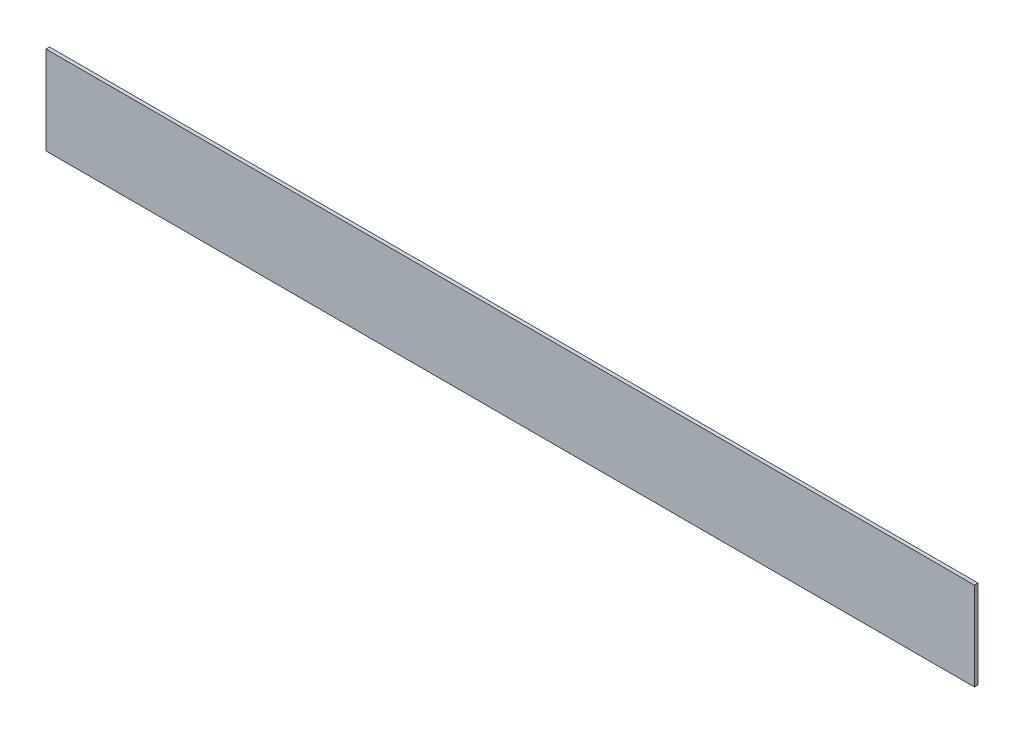
ISO-10303-21;
HEADER;
FILE_DESCRIPTION(('STEP AP214'),'2;1');
FILE_NAME('part.step','',(''),(''),'','','');
FILE_SCHEMA(('AUTOMOTIVE_DESIGN { 1 0 10303 214 1 1 1 1 }'));
ENDSEC;
DATA;
#1=APPLICATION_CONTEXT('core data for automotive mechanical design processes');
#2=APPLICATION_PROTOCOL_DEFINITION('international standard','automotive_design',2000,#1);
#3=PRODUCT_CONTEXT('',#1,'mechanical');
#4=PRODUCT('Part','Part','',(#3));
#5=PRODUCT_RELATED_PRODUCT_CATEGORY('part','',(#4));
#6=PRODUCT_DEFINITION_FORMATION('','',#4);
#7=PRODUCT_DEFINITION_CONTEXT('part definition',#1,'design');
#8=PRODUCT_DEFINITION('design','',#6,#7);
#9=PRODUCT_DEFINITION_SHAPE('','',#8);
#10=(LENGTH_UNIT() NAMED_UNIT(*) SI_UNIT(.MILLI.,.METRE.));
#11=(NAMED_UNIT(*) PLANE_ANGLE_UNIT() SI_UNIT($,.RADIAN.));
#12=(NAMED_UNIT(*) SI_UNIT($,.STERADIAN.) SOLID_ANGLE_UNIT());
#13=UNCERTAINTY_MEASURE_WITH_UNIT(LENGTH_MEASURE(1.E-05),#10,'distance_accuracy_value','');
#14=(GEOMETRIC_REPRESENTATION_CONTEXT(3) GLOBAL_UNCERTAINTY_ASSIGNED_CONTEXT((#13)) GLOBAL_UNIT_ASSIGNED_CONTEXT((#10,
#11,#12)) REPRESENTATION_CONTEXT('',''));
#15=CARTESIAN_POINT('',(0.,0.,0.));
#16=DIRECTION('',(0.,0.,1.));
#17=DIRECTION('',(1.,0.,0.));
#18=AXIS2_PLACEMENT_3D('',#15,#16,#17);
#19=CARTESIAN_POINT('',(-262.860436893204,1093.,778.732828821742));
#20=DIRECTION('',(-1.,0.,0.));
#21=DIRECTION('',(0.,0.,1.));
#22=AXIS2_PLACEMENT_3D('',#19,#20,#21);
#23=PLANE('',#22);
#24=DIRECTION('',(0.,-1.,0.));
#25=VECTOR('',#24,1.);
#26=CARTESIAN_POINT('',(-262.860436893204,1093.,780.732828821742));
#27=LINE('',#26,#25);
#28=CARTESIAN_POINT('',(-262.860436893204,1093.,780.732828821742));
#29=VERTEX_POINT('',#28);
#30=CARTESIAN_POINT('',(-262.860436893204,1043.,780.732828821742));
#31=VERTEX_POINT('',#30);
#32=EDGE_CURVE('E111',#29,#31,#27,.T.);
#33=ORIENTED_EDGE('',*,*,#32,.F.);
#34=DIRECTION('',(0.,0.,1.));
#35=VECTOR('',#34,1.);
#36=CARTESIAN_POINT('',(-262.860436893204,1093.,778.732828821742));
#37=LINE('',#36,#35);
#38=CARTESIAN_POINT('',(-262.860436893204,1093.,778.732828821742));
#39=VERTEX_POINT('',#38);
#40=EDGE_CURVE('E11',#39,#29,#37,.T.);
#41=ORIENTED_EDGE('',*,*,#40,.F.);
#42=DIRECTION('',(0.,-1.,0.));
#43=VECTOR('',#42,1.);
#44=CARTESIAN_POINT('',(-262.860436893204,1093.,778.732828821742));
#45=LINE('',#44,#43);
#46=CARTESIAN_POINT('',(-262.860436893204,1043.,778.732828821742));
#47=VERTEX_POINT('',#46);
#48=EDGE_CURVE('E102',#39,#47,#45,.T.);
#49=ORIENTED_EDGE('',*,*,#48,.T.);
#50=DIRECTION('',(0.,0.,1.));
#51=VECTOR('',#50,1.);
#52=CARTESIAN_POINT('',(-262.860436893204,1043.,778.732828821742));
#53=LINE('',#52,#51);
#54=EDGE_CURVE('E43',#47,#31,#53,.T.);
#55=ORIENTED_EDGE('',*,*,#54,.T.);
#56=EDGE_LOOP('',(#33,#41,#49,#55));
#57=FACE_BOUND('',#56,.T.);
#58=ADVANCED_FACE('F40',(#57),#23,.T.);
#59=CARTESIAN_POINT('',(-262.860436893204,1093.,778.732828821742));
#60=DIRECTION('',(0.,1.,0.));
#61=DIRECTION('',(0.,0.,1.));
#62=AXIS2_PLACEMENT_3D('',#59,#60,#61);
#63=PLANE('',#62);
#64=DIRECTION('',(-1.,0.,0.));
#65=VECTOR('',#64,1.);
#66=CARTESIAN_POINT('',(-262.860436893204,1093.,780.732828821742));
#67=LINE('',#66,#65);
#68=CARTESIAN_POINT('',(262.860436893204,1093.,780.732828821742));
#69=VERTEX_POINT('',#68);
#70=EDGE_CURVE('E106',#69,#29,#67,.T.);
#71=ORIENTED_EDGE('',*,*,#70,.F.);
#72=DIRECTION('',(0.,0.,1.));
#73=VECTOR('',#72,1.);
#74=CARTESIAN_POINT('',(262.860436893204,1093.,778.732828821742));
#75=LINE('',#74,#73);
#76=CARTESIAN_POINT('',(262.860436893204,1093.,778.732828821742));
#77=VERTEX_POINT('',#76);
#78=EDGE_CURVE('E50',#77,#69,#75,.T.);
#79=ORIENTED_EDGE('',*,*,#78,.F.);
#80=DIRECTION('',(-1.,0.,0.));
#81=VECTOR('',#80,1.);
#82=CARTESIAN_POINT('',(-262.860436893204,1093.,778.732828821742));
#83=LINE('',#82,#81);
#84=EDGE_CURVE('E97',#77,#39,#83,.T.);
#85=ORIENTED_EDGE('',*,*,#84,.T.);
#86=ORIENTED_EDGE('',*,*,#40,.T.);
#87=EDGE_LOOP('',(#71,#79,#85,#86));
#88=FACE_BOUND('',#87,.T.);
#89=ADVANCED_FACE('F130',(#88),#63,.T.);
#90=CARTESIAN_POINT('',(262.860436893204,1093.,778.732828821742));
#91=DIRECTION('',(1.,0.,0.));
#92=DIRECTION('',(0.,0.,-1.));
#93=AXIS2_PLACEMENT_3D('',#90,#91,#92);
#94=PLANE('',#93);
#95=DIRECTION('',(0.,1.,0.));
#96=VECTOR('',#95,1.);
#97=CARTESIAN_POINT('',(262.860436893204,1093.,780.732828821742));
#98=LINE('',#97,#96);
#99=CARTESIAN_POINT('',(262.860436893204,1043.,780.732828821742));
#100=VERTEX_POINT('',#99);
#101=EDGE_CURVE('E91',#100,#69,#98,.T.);
#102=ORIENTED_EDGE('',*,*,#101,.F.);
#103=DIRECTION('',(0.,0.,1.));
#104=VECTOR('',#103,1.);
#105=CARTESIAN_POINT('',(262.860436893204,1043.,778.732828821742));
#106=LINE('',#105,#104);
#107=CARTESIAN_POINT('',(262.860436893204,1043.,778.732828821742));
#108=VERTEX_POINT('',#107);
#109=EDGE_CURVE('E86',#108,#100,#106,.T.);
#110=ORIENTED_EDGE('',*,*,#109,.F.);
#111=DIRECTION('',(0.,1.,0.));
#112=VECTOR('',#111,1.);
#113=CARTESIAN_POINT('',(262.860436893204,1093.,778.732828821742));
#114=LINE('',#113,#112);
#115=EDGE_CURVE('E89',#108,#77,#114,.T.);
#116=ORIENTED_EDGE('',*,*,#115,.T.);
#117=ORIENTED_EDGE('',*,*,#78,.T.);
#118=EDGE_LOOP('',(#102,#110,#116,#117));
#119=FACE_BOUND('',#118,.T.);
#120=ADVANCED_FACE('F88',(#119),#94,.T.);
#121=CARTESIAN_POINT('',(-262.860436893204,1043.,778.732828821742));
#122=DIRECTION('',(0.,-1.,0.));
#123=DIRECTION('',(0.,0.,-1.));
#124=AXIS2_PLACEMENT_3D('',#121,#122,#123);
#125=PLANE('',#124);
#126=DIRECTION('',(1.,0.,0.));
#127=VECTOR('',#126,1.);
#128=CARTESIAN_POINT('',(-262.860436893204,1043.,780.732828821742));
#129=LINE('',#128,#127);
#130=EDGE_CURVE('E115',#31,#100,#129,.T.);
#131=ORIENTED_EDGE('',*,*,#130,.F.);
#132=ORIENTED_EDGE('',*,*,#54,.F.);
#133=DIRECTION('',(1.,0.,0.));
#134=VECTOR('',#133,1.);
#135=CARTESIAN_POINT('',(-262.860436893204,1043.,778.732828821742));
#136=LINE('',#135,#134);
#137=EDGE_CURVE('E96',#47,#108,#136,.T.);
#138=ORIENTED_EDGE('',*,*,#137,.T.);
#139=ORIENTED_EDGE('',*,*,#109,.T.);
#140=EDGE_LOOP('',(#131,#132,#138,#139));
#141=FACE_BOUND('',#140,.T.);
#142=ADVANCED_FACE('F100',(#141),#125,.T.);
#143=CARTESIAN_POINT('',(0.,0.,778.732828821742));
#144=DIRECTION('',(0.,0.,1.));
#145=DIRECTION('',(1.,0.,0.));
#146=AXIS2_PLACEMENT_3D('',#143,#144,#145);
#147=PLANE('',#146);
#148=ORIENTED_EDGE('',*,*,#48,.F.);
#149=ORIENTED_EDGE('',*,*,#84,.F.);
#150=ORIENTED_EDGE('',*,*,#115,.F.);
#151=ORIENTED_EDGE('',*,*,#137,.F.);
#152=EDGE_LOOP('',(#148,#149,#150,#151));
#153=FACE_BOUND('',#152,.T.);
#154=ADVANCED_FACE('F95',(#153),#147,.F.);
#155=CARTESIAN_POINT('',(0.,0.,780.732828821742));
#156=DIRECTION('',(0.,0.,1.));
#157=DIRECTION('',(1.,0.,0.));
#158=AXIS2_PLACEMENT_3D('',#155,#156,#157);
#159=PLANE('',#158);
#160=ORIENTED_EDGE('',*,*,#32,.T.);
#161=ORIENTED_EDGE('',*,*,#130,.T.);
#162=ORIENTED_EDGE('',*,*,#101,.T.);
#163=ORIENTED_EDGE('',*,*,#70,.T.);
#164=EDGE_LOOP('',(#160,#161,#162,#163));
#165=FACE_BOUND('',#164,.T.);
#166=ADVANCED_FACE('F129',(#165),#159,.T.);
#167=CLOSED_SHELL('',(#58,#89,#120,#142,#154,#166));
#168=MANIFOLD_SOLID_BREP('B2',#167);
#169=ADVANCED_BREP_SHAPE_REPRESENTATION('',(#18,#168),#14);
#170=SHAPE_DEFINITION_REPRESENTATION(#9,#169);
ENDSEC;
END-ISO-10303-21;
